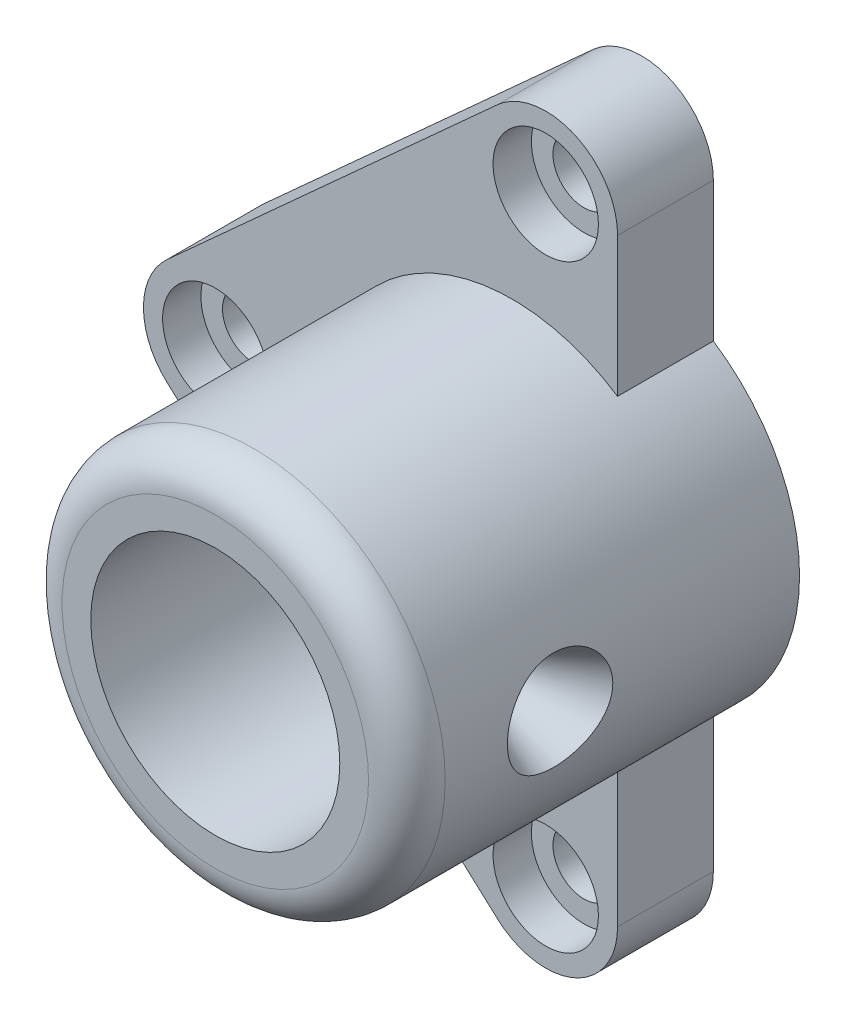
ISO-10303-21;
HEADER;
FILE_DESCRIPTION(('STEP AP214'),'2;1');
FILE_NAME('part.step','',(''),(''),'','','');
FILE_SCHEMA(('AUTOMOTIVE_DESIGN { 1 0 10303 214 1 1 1 1 }'));
ENDSEC;
DATA;
#1=APPLICATION_CONTEXT('core data for automotive mechanical design processes');
#2=APPLICATION_PROTOCOL_DEFINITION('international standard','automotive_design',2000,#1);
#3=PRODUCT_CONTEXT('',#1,'mechanical');
#4=PRODUCT('Part','Part','',(#3));
#5=PRODUCT_RELATED_PRODUCT_CATEGORY('part','',(#4));
#6=PRODUCT_DEFINITION_FORMATION('','',#4);
#7=PRODUCT_DEFINITION_CONTEXT('part definition',#1,'design');
#8=PRODUCT_DEFINITION('design','',#6,#7);
#9=PRODUCT_DEFINITION_SHAPE('','',#8);
#10=(LENGTH_UNIT() NAMED_UNIT(*) SI_UNIT(.MILLI.,.METRE.));
#11=(NAMED_UNIT(*) PLANE_ANGLE_UNIT() SI_UNIT($,.RADIAN.));
#12=(NAMED_UNIT(*) SI_UNIT($,.STERADIAN.) SOLID_ANGLE_UNIT());
#13=UNCERTAINTY_MEASURE_WITH_UNIT(LENGTH_MEASURE(1.E-05),#10,'distance_accuracy_value','');
#14=(GEOMETRIC_REPRESENTATION_CONTEXT(3) GLOBAL_UNCERTAINTY_ASSIGNED_CONTEXT((#13)) GLOBAL_UNIT_ASSIGNED_CONTEXT((#10,
#11,#12)) REPRESENTATION_CONTEXT('',''));
#15=CARTESIAN_POINT('',(0.,0.,0.));
#16=DIRECTION('',(0.,0.,1.));
#17=DIRECTION('',(1.,0.,0.));
#18=AXIS2_PLACEMENT_3D('',#15,#16,#17);
#19=CARTESIAN_POINT('',(0.,0.,82.));
#20=DIRECTION('',(0.,0.,-1.));
#21=DIRECTION('',(-1.,0.,0.));
#22=AXIS2_PLACEMENT_3D('',#19,#20,#21);
#23=CYLINDRICAL_SURFACE('',#22,26.);
#24=CARTESIAN_POINT('',(0.,0.,82.));
#25=DIRECTION('',(0.,0.,1.));
#26=DIRECTION('',(1.,0.,0.));
#27=AXIS2_PLACEMENT_3D('',#24,#25,#26);
#28=CIRCLE('',#27,26.);
#29=CARTESIAN_POINT('',(26.,0.,82.));
#30=VERTEX_POINT('',#29);
#31=EDGE_CURVE('E177',#30,#30,#28,.T.);
#32=ORIENTED_EDGE('',*,*,#31,.T.);
#33=EDGE_LOOP('',(#32));
#34=FACE_BOUND('',#33,.T.);
#35=CARTESIAN_POINT('',(26.,0.,45.));
#36=CARTESIAN_POINT('',(26.00000128243,-0.139098195780729,44.9999973910361));
#37=CARTESIAN_POINT('',(25.9988817850533,-0.278163093367462,45.005806065915));
#38=CARTESIAN_POINT('',(25.9944378015782,-0.555334569910838,45.028990391674));
#39=CARTESIAN_POINT('',(25.9911128838052,-0.69344095590614,45.0463683070441));
#40=CARTESIAN_POINT('',(25.9823468638532,-0.967727876986162,45.0925709934681));
#41=CARTESIAN_POINT('',(25.9769046295694,-1.10390734132981,45.121401888473));
#42=CARTESIAN_POINT('',(25.9640539710597,-1.37335317178624,45.1902969006897));
#43=CARTESIAN_POINT('',(25.9566448244308,-1.5066184480786,45.2303651454352));
#44=CARTESIAN_POINT('',(25.9400777859745,-1.76907725225023,45.3213642345133));
#45=CARTESIAN_POINT('',(25.9309221931612,-1.89827587582844,45.3722808083452));
#46=CARTESIAN_POINT('',(25.911104430191,-2.15194332659034,45.4846494437478));
#47=CARTESIAN_POINT('',(25.9004417048189,-2.27641038916633,45.546105389725));
#48=CARTESIAN_POINT('',(25.8779094191981,-2.51966664126715,45.6790644055367));
#49=CARTESIAN_POINT('',(25.8660404147299,-2.63845840886966,45.7505628541409));
#50=CARTESIAN_POINT('',(25.8414102153448,-2.86967642451499,45.9031535022098));
#51=CARTESIAN_POINT('',(25.8286486884198,-2.98210027531709,45.9842492796186));
#52=CARTESIAN_POINT('',(25.8024421572251,-3.20097821057031,46.1563905233969));
#53=CARTESIAN_POINT('',(25.7889912217317,-3.30735391905022,46.247534756282));
#54=CARTESIAN_POINT('',(25.7619048227286,-3.51211211706086,46.4384456248307));
#55=CARTESIAN_POINT('',(25.7482692927008,-3.61049163064933,46.5382154424266));
#56=CARTESIAN_POINT('',(25.721202853471,-3.79851889966349,46.7456425873518));
#57=CARTESIAN_POINT('',(25.707771885596,-3.88816920018256,46.8532975995329));
#58=CARTESIAN_POINT('',(25.6814824984122,-4.05818429427359,47.0758321048208));
#59=CARTESIAN_POINT('',(25.6686242920977,-4.13854565097106,47.1907142478157));
#60=CARTESIAN_POINT('',(25.6437507491722,-4.28998732526708,47.4278516555159));
#61=CARTESIAN_POINT('',(25.6317429902835,-4.36098813212465,47.550158615209));
#62=CARTESIAN_POINT('',(25.6090303907993,-4.49243737988195,47.8004482275122));
#63=CARTESIAN_POINT('',(25.5983260389411,-4.55288186615487,47.9284329847288));
#64=CARTESIAN_POINT('',(25.5686725756277,-4.71758356517903,48.3194693572835));
#65=CARTESIAN_POINT('',(25.5521520068429,-4.80539082913906,48.5898880790335));
#66=CARTESIAN_POINT('',(25.5277851059543,-4.93319348500814,49.1385519824114));
#67=CARTESIAN_POINT('',(25.5198358125422,-4.9737568737807,49.416662138497));
#68=CARTESIAN_POINT('',(25.5131829043982,-5.00777610628065,49.9758846697083));
#69=CARTESIAN_POINT('',(25.5144784168635,-5.00123639701493,50.2569967589193));
#70=CARTESIAN_POINT('',(25.5260802151496,-4.94166940783617,50.8100732300795));
#71=CARTESIAN_POINT('',(25.5362611084689,-4.88928901385649,51.082110435608));
#72=CARTESIAN_POINT('',(25.5642880886633,-4.74055376184226,51.6134652201195));
#73=CARTESIAN_POINT('',(25.5821345165446,-4.64419694747603,51.8727822326645));
#74=CARTESIAN_POINT('',(25.6236120486049,-4.40961541759395,52.3732140894093));
#75=CARTESIAN_POINT('',(25.6472788082827,-4.27113134100965,52.6142042751129));
#76=CARTESIAN_POINT('',(25.6977069479892,-3.95641007271873,53.0697698881744));
#77=CARTESIAN_POINT('',(25.7244686576829,-3.78016885752474,53.2843424965743));
#78=CARTESIAN_POINT('',(25.7786164745845,-3.39145783063179,53.6847170832932));
#79=CARTESIAN_POINT('',(25.8060055726474,-3.1784352252573,53.869982384059));
#80=CARTESIAN_POINT('',(25.8579144210111,-2.72405331017049,54.2022310106155));
#81=CARTESIAN_POINT('',(25.8824341396341,-2.48269368767764,54.349213913792));
#82=CARTESIAN_POINT('',(25.9258949720895,-1.97791552554967,54.6008120951711));
#83=CARTESIAN_POINT('',(25.9448284520921,-1.71446742623273,54.705369469608));
#84=CARTESIAN_POINT('',(25.9749249443633,-1.17330113824765,54.8685948463202));
#85=CARTESIAN_POINT('',(25.9860888256766,-0.895584549270348,54.9272679809275));
#86=CARTESIAN_POINT('',(25.9992682565874,-0.338379830303339,54.9963075327037));
#87=CARTESIAN_POINT('',(26.0014229870363,-0.0589859559045563,55.0074089448941));
#88=CARTESIAN_POINT('',(25.9967265998234,0.497665273099564,54.9829644443947));
#89=CARTESIAN_POINT('',(25.9898759486079,0.774922737615086,54.9474209477441));
#90=CARTESIAN_POINT('',(25.9680253741972,1.31708448551589,54.8313065164243));
#91=CARTESIAN_POINT('',(25.9530931455519,1.58207180878127,54.7511094595413));
#92=CARTESIAN_POINT('',(25.9167470904917,2.0948391106724,54.5483704233571));
#93=CARTESIAN_POINT('',(25.8953328064491,2.34261787286919,54.4258254542422));
#94=CARTESIAN_POINT('',(25.8480509279767,2.81705737037191,54.1402565755127));
#95=CARTESIAN_POINT('',(25.822135234877,3.04344438938756,53.9767860490185));
#96=CARTESIAN_POINT('',(25.7688451137708,3.46583719199924,53.6146073208902));
#97=CARTESIAN_POINT('',(25.7414705421556,3.66183997719088,53.4158956457006));
#98=CARTESIAN_POINT('',(25.6878832381845,4.02071027471095,52.9855445559817));
#99=CARTESIAN_POINT('',(25.6616921581473,4.18307505303114,52.7534828004893));
#100=CARTESIAN_POINT('',(25.6138822201812,4.46651870841569,52.2649360505246));
#101=CARTESIAN_POINT('',(25.5922631871101,4.58759916707369,52.0084519921474));
#102=CARTESIAN_POINT('',(25.5562146077168,4.78433868028939,51.4796395448304));
#103=CARTESIAN_POINT('',(25.5417494261111,4.86022326245296,51.2073973927492));
#104=CARTESIAN_POINT('',(25.521575749456,4.96509210074319,50.6535641994356));
#105=CARTESIAN_POINT('',(25.5158662089013,4.99408195656079,50.3719742785173));
#106=CARTESIAN_POINT('',(25.5143666040174,5.00169745119354,49.9515799904159));
#107=CARTESIAN_POINT('',(25.5150115622038,4.9984233730953,49.8128848027259));
#108=CARTESIAN_POINT('',(25.5185418770053,4.98037531938878,49.536287506806));
#109=CARTESIAN_POINT('',(25.5214263855741,4.96560569677111,49.3983851182765));
#110=CARTESIAN_POINT('',(25.5293565631499,4.92467036099147,49.1243066837505));
#111=CARTESIAN_POINT('',(25.5344029923743,4.89850063904593,48.9881312623834));
#112=CARTESIAN_POINT('',(25.5465062848218,4.83498318828809,48.7185539777311));
#113=CARTESIAN_POINT('',(25.553562429272,4.79763945560994,48.5851511411031));
#114=CARTESIAN_POINT('',(25.5694685515132,4.71212938240753,48.3222291441991));
#115=CARTESIAN_POINT('',(25.578315400985,4.66398190006566,48.192703657143));
#116=CARTESIAN_POINT('',(25.5975551763323,4.55720406797804,47.9382228949703));
#117=CARTESIAN_POINT('',(25.6079475533512,4.49857743816031,47.8132660169701));
#118=CARTESIAN_POINT('',(25.6299934506701,4.37122536460538,47.5686609819221));
#119=CARTESIAN_POINT('',(25.6416474869804,4.30249578468483,47.4490150254296));
#120=CARTESIAN_POINT('',(25.6658855163733,4.15546242716184,47.2159176939682));
#121=CARTESIAN_POINT('',(25.6784691878078,4.07716195494949,47.1024641998503));
#122=CARTESIAN_POINT('',(25.7044327109533,3.9101651450708,46.880675264668));
#123=CARTESIAN_POINT('',(25.7178221224797,3.82132166725485,46.7724517027036));
#124=CARTESIAN_POINT('',(25.7448283120819,3.63492472447239,46.5638864100167));
#125=CARTESIAN_POINT('',(25.7584450082883,3.53737434299833,46.4635419124541));
#126=CARTESIAN_POINT('',(25.7855394220868,3.33413706596718,46.271313150041));
#127=CARTESIAN_POINT('',(25.7990170524896,3.22844538044321,46.1794339366645));
#128=CARTESIAN_POINT('',(25.8254458734074,3.00972964248704,46.0048656861615));
#129=CARTESIAN_POINT('',(25.8383972560048,2.89670830522931,45.9221732763532));
#130=CARTESIAN_POINT('',(25.86354410547,2.66290145933283,45.7657426779706));
#131=CARTESIAN_POINT('',(25.8757307714914,2.54204990146172,45.6921017420601));
#132=CARTESIAN_POINT('',(25.8988560060756,2.29449473444564,45.555308013524));
#133=CARTESIAN_POINT('',(25.9097950324044,2.16779329578012,45.4921513702538));
#134=CARTESIAN_POINT('',(25.9301122185035,1.9094626859203,45.3768035814581));
#135=CARTESIAN_POINT('',(25.9394913571846,1.77783666917816,45.324605553393));
#136=CARTESIAN_POINT('',(25.9564273535261,1.51057041709534,45.2315404223472));
#137=CARTESIAN_POINT('',(25.9639845721592,1.37493098291215,45.1906710746022));
#138=CARTESIAN_POINT('',(25.980137569936,1.03593953494328,45.1040663401127));
#139=CARTESIAN_POINT('',(25.9875482864984,0.830762807269964,45.0650929543648));
#140=CARTESIAN_POINT('',(25.9974784726212,0.417032390492763,45.0130620990212));
#141=CARTESIAN_POINT('',(25.9999980779085,0.208478795258006,45.0000039102855));
#142=CARTESIAN_POINT('',(26.,0.,45.));
#143=B_SPLINE_CURVE_WITH_KNOTS('',3,(#35,#36,#37,#38,#39,#40,#41,#42,#43,#44,#45,#46,#47,#48,
#49,#50,#51,#52,#53,#54,#55,#56,#57,#58,#59,#60,#61,#62,#63,#64,#65,#66,#67,#68,#69,#70,#71,#72,
#73,#74,#75,#76,#77,#78,#79,#80,#81,#82,#83,#84,#85,#86,#87,#88,#89,#90,#91,#92,#93,#94,#95,#96,
#97,#98,#99,#100,#101,#102,#103,#104,#105,#106,#107,#108,#109,#110,#111,#112,#113,#114,#115,
#116,#117,#118,#119,#120,#121,#122,#123,#124,#125,#126,#127,#128,#129,#130,#131,#132,#133,#134,
#135,#136,#137,#138,#139,#140,#141,#142),.UNSPECIFIED.,.T.,.F.,(4,2,2,2,2,2,2,2,2,2,2,2,2,2,2,2,
2,2,2,2,2,2,2,2,2,2,2,2,2,2,2,2,2,2,2,2,2,2,2,2,2,2,2,2,2,2,2,2,2,2,2,2,2,4),(0.,
0.417111611398396,0.834304889598899,1.25172154351447,1.66929171786899,2.08631595147723,
2.50349421576772,2.92048113344245,3.33762399907484,3.7593111675501,4.18115456341101,
4.60287459580003,5.0247501669197,5.45000550525302,5.87541981332372,6.72524307938186,
7.56474015655585,8.40415797778932,9.23191787086898,10.0597145912015,10.8927145742863,
11.7258033679538,12.5727204483932,13.4196468778793,14.267725363681,15.1157089750067,
15.9505426908707,16.7853331670463,17.6132369467634,18.4411991894332,19.2786239959612,
20.1161313894649,20.9653730722101,21.8145822170279,22.6595175077965,23.5043518975422,
23.9201518330802,24.3357943951977,24.7515832339167,25.1672235524515,25.5821439287858,
25.9969173065549,26.4118609694065,26.8266617306505,27.2481441020027,27.6694777959548,
28.0910613049364,28.5124895260964,28.938109821233,29.3635734480985,29.7887690585655,
30.213880356713,30.839059849035,31.4642219925436),.UNSPECIFIED.);
#144=CARTESIAN_POINT('',(26.,0.,45.));
#145=VERTEX_POINT('',#144);
#146=EDGE_CURVE('E190',#145,#145,#143,.T.);
#147=ORIENTED_EDGE('',*,*,#146,.F.);
#148=EDGE_LOOP('',(#147));
#149=FACE_BOUND('',#148,.T.);
#150=CARTESIAN_POINT('',(0.,0.,6.00000000000001));
#151=DIRECTION('',(0.,0.,-1.));
#152=DIRECTION('',(-1.,0.,0.));
#153=AXIS2_PLACEMENT_3D('',#150,#151,#152);
#154=CIRCLE('',#153,26.);
#155=CARTESIAN_POINT('',(-26.,0.,6.00000000000001));
#156=VERTEX_POINT('',#155);
#157=EDGE_CURVE('E51',#156,#156,#154,.T.);
#158=ORIENTED_EDGE('',*,*,#157,.T.);
#159=EDGE_LOOP('',(#158));
#160=FACE_BOUND('',#159,.T.);
#161=ADVANCED_FACE('F47',(#34,#149,#160),#23,.F.);
#162=CARTESIAN_POINT('',(0.,0.,82.));
#163=DIRECTION('',(0.,0.,1.));
#164=DIRECTION('',(1.,0.,0.));
#165=AXIS2_PLACEMENT_3D('',#162,#163,#164);
#166=PLANE('',#165);
#167=CARTESIAN_POINT('',(0.,0.,82.));
#168=DIRECTION('',(0.,0.,1.));
#169=DIRECTION('',(1.,0.,0.));
#170=AXIS2_PLACEMENT_3D('',#167,#168,#169);
#171=CIRCLE('',#170,32.);
#172=CARTESIAN_POINT('',(32.,0.,82.));
#173=VERTEX_POINT('',#172);
#174=EDGE_CURVE('E182',#173,#173,#171,.T.);
#175=ORIENTED_EDGE('',*,*,#174,.T.);
#176=EDGE_LOOP('',(#175));
#177=FACE_BOUND('',#176,.T.);
#178=ORIENTED_EDGE('',*,*,#31,.F.);
#179=EDGE_LOOP('',(#178));
#180=FACE_BOUND('',#179,.T.);
#181=ADVANCED_FACE('F276',(#177,#180),#166,.T.);
#182=CARTESIAN_POINT('',(0.,0.,0.));
#183=DIRECTION('',(0.,0.,1.));
#184=DIRECTION('',(1.,0.,0.));
#185=AXIS2_PLACEMENT_3D('',#182,#183,#184);
#186=PLANE('',#185);
#187=CARTESIAN_POINT('',(0.,0.,0.));
#188=DIRECTION('',(0.,0.,-1.));
#189=DIRECTION('',(-1.,0.,0.));
#190=AXIS2_PLACEMENT_3D('',#187,#188,#189);
#191=CIRCLE('',#190,30.);
#192=CARTESIAN_POINT('',(-30.,0.,0.));
#193=VERTEX_POINT('',#192);
#194=EDGE_CURVE('E291',#193,#193,#191,.T.);
#195=ORIENTED_EDGE('',*,*,#194,.F.);
#196=EDGE_LOOP('',(#195));
#197=FACE_BOUND('',#196,.T.);
#198=CARTESIAN_POINT('',(-62.,0.,0.));
#199=DIRECTION('',(0.,0.,1.));
#200=DIRECTION('',(1.,0.,0.));
#201=AXIS2_PLACEMENT_3D('',#198,#199,#200);
#202=CIRCLE('',#201,6.5);
#203=CARTESIAN_POINT('',(-55.5,0.,0.));
#204=VERTEX_POINT('',#203);
#205=EDGE_CURVE('E295',#204,#204,#202,.T.);
#206=ORIENTED_EDGE('',*,*,#205,.T.);
#207=EDGE_LOOP('',(#206));
#208=FACE_BOUND('',#207,.T.);
#209=CARTESIAN_POINT('',(7.,62.5,0.));
#210=DIRECTION('',(0.,0.,1.));
#211=DIRECTION('',(1.,0.,0.));
#212=AXIS2_PLACEMENT_3D('',#209,#210,#211);
#213=CIRCLE('',#212,6.5);
#214=CARTESIAN_POINT('',(13.5,62.5,0.));
#215=VERTEX_POINT('',#214);
#216=EDGE_CURVE('E299',#215,#215,#213,.T.);
#217=ORIENTED_EDGE('',*,*,#216,.T.);
#218=EDGE_LOOP('',(#217));
#219=FACE_BOUND('',#218,.T.);
#220=CARTESIAN_POINT('',(7.,-62.5,0.));
#221=DIRECTION('',(0.,0.,1.));
#222=DIRECTION('',(1.,0.,0.));
#223=AXIS2_PLACEMENT_3D('',#220,#221,#222);
#224=CIRCLE('',#223,6.5);
#225=CARTESIAN_POINT('',(13.5,-62.5,0.));
#226=VERTEX_POINT('',#225);
#227=EDGE_CURVE('E149',#226,#226,#224,.T.);
#228=ORIENTED_EDGE('',*,*,#227,.T.);
#229=EDGE_LOOP('',(#228));
#230=FACE_BOUND('',#229,.T.);
#231=CARTESIAN_POINT('',(0.,0.,0.));
#232=DIRECTION('',(0.,0.,1.));
#233=DIRECTION('',(1.,0.,0.));
#234=AXIS2_PLACEMENT_3D('',#231,#232,#233);
#235=CIRCLE('',#234,40.);
#236=CARTESIAN_POINT('',(22.,-33.4065861769801,0.));
#237=VERTEX_POINT('',#236);
#238=CARTESIAN_POINT('',(22.,33.4065861769801,0.));
#239=VERTEX_POINT('',#238);
#240=EDGE_CURVE('E180',#237,#239,#235,.T.);
#241=ORIENTED_EDGE('',*,*,#240,.F.);
#242=DIRECTION('',(0.,1.,0.));
#243=VECTOR('',#242,1.);
#244=CARTESIAN_POINT('',(22.,-62.5,0.));
#245=LINE('',#244,#243);
#246=CARTESIAN_POINT('',(22.,-62.5,0.));
#247=VERTEX_POINT('',#246);
#248=EDGE_CURVE('E119',#247,#237,#245,.T.);
#249=ORIENTED_EDGE('',*,*,#248,.F.);
#250=CARTESIAN_POINT('',(7.,-62.5,0.));
#251=DIRECTION('',(0.,0.,1.));
#252=DIRECTION('',(1.,0.,0.));
#253=AXIS2_PLACEMENT_3D('',#250,#251,#252);
#254=CIRCLE('',#253,15.);
#255=CARTESIAN_POINT('',(-3.0700265267584,-73.6173092855413,0.));
#256=VERTEX_POINT('',#255);
#257=EDGE_CURVE('E157',#256,#247,#254,.T.);
#258=ORIENTED_EDGE('',*,*,#257,.F.);
#259=DIRECTION('',(0.741153952369418,-0.671335101783893,0.));
#260=VECTOR('',#259,1.);
#261=CARTESIAN_POINT('',(-3.07002652675839,-73.6173092855413,0.));
#262=LINE('',#261,#260);
#263=CARTESIAN_POINT('',(-72.0700265267584,-11.1173092855413,0.));
#264=VERTEX_POINT('',#263);
#265=EDGE_CURVE('E155',#264,#256,#262,.T.);
#266=ORIENTED_EDGE('',*,*,#265,.F.);
#267=CARTESIAN_POINT('',(-62.,0.,0.));
#268=DIRECTION('',(0.,0.,1.));
#269=DIRECTION('',(-1.,0.,0.));
#270=AXIS2_PLACEMENT_3D('',#267,#268,#269);
#271=CIRCLE('',#270,15.);
#272=CARTESIAN_POINT('',(-72.0700265267584,11.1173092855413,0.));
#273=VERTEX_POINT('',#272);
#274=EDGE_CURVE('E153',#273,#264,#271,.T.);
#275=ORIENTED_EDGE('',*,*,#274,.F.);
#276=DIRECTION('',(-0.741153952369418,-0.671335101783893,0.));
#277=VECTOR('',#276,1.);
#278=CARTESIAN_POINT('',(-72.0700265267584,11.1173092855413,0.));
#279=LINE('',#278,#277);
#280=CARTESIAN_POINT('',(-3.07002652675839,73.6173092855413,0.));
#281=VERTEX_POINT('',#280);
#282=EDGE_CURVE('E151',#281,#273,#279,.T.);
#283=ORIENTED_EDGE('',*,*,#282,.F.);
#284=CARTESIAN_POINT('',(7.,62.5,0.));
#285=DIRECTION('',(0.,0.,1.));
#286=DIRECTION('',(-1.,0.,0.));
#287=AXIS2_PLACEMENT_3D('',#284,#285,#286);
#288=CIRCLE('',#287,15.);
#289=CARTESIAN_POINT('',(22.,62.5,0.));
#290=VERTEX_POINT('',#289);
#291=EDGE_CURVE('E148',#290,#281,#288,.T.);
#292=ORIENTED_EDGE('',*,*,#291,.F.);
#293=DIRECTION('',(0.,1.,0.));
#294=VECTOR('',#293,1.);
#295=CARTESIAN_POINT('',(22.,62.5,0.));
#296=LINE('',#295,#294);
#297=EDGE_CURVE('E125',#239,#290,#296,.T.);
#298=ORIENTED_EDGE('',*,*,#297,.F.);
#299=EDGE_LOOP('',(#241,#249,#258,#266,#275,#283,#292,#298));
#300=FACE_BOUND('',#299,.T.);
#301=ADVANCED_FACE('F279',(#197,#208,#219,#230,#300),#186,.F.);
#302=CARTESIAN_POINT('',(0.,0.,82.));
#303=DIRECTION('',(0.,0.,-1.));
#304=DIRECTION('',(-1.,0.,0.));
#305=AXIS2_PLACEMENT_3D('',#302,#303,#304);
#306=CYLINDRICAL_SURFACE('',#305,40.);
#307=CARTESIAN_POINT('',(39.2750817255295,-7.58076530877896,42.5027016648812));
#308=CARTESIAN_POINT('',(39.2348742803046,-7.78907626430152,42.7399912601435));
#309=CARTESIAN_POINT('',(39.1949630201123,-7.986948315553,42.9864165670778));
#310=CARTESIAN_POINT('',(39.1169103018654,-8.36084960361184,43.4957077083518));
#311=CARTESIAN_POINT('',(39.0787693286866,-8.53687287795806,43.7585780011686));
#312=CARTESIAN_POINT('',(39.0053753361394,-8.86618294648203,44.2989289708946));
#313=CARTESIAN_POINT('',(38.9701252542205,-9.01944673971651,44.5764240492629));
#314=CARTESIAN_POINT('',(38.9036048230007,-9.30218429787523,45.1437374980762));
#315=CARTESIAN_POINT('',(38.8723344725372,-9.43165806974972,45.4335558649209));
#316=CARTESIAN_POINT('',(38.8151304829796,-9.66435700452859,46.0190731058962));
#317=CARTESIAN_POINT('',(38.7891250969262,-9.76794032094785,46.3146227319419));
#318=CARTESIAN_POINT('',(38.7426390787253,-9.95071946650734,46.9135947059881));
#319=CARTESIAN_POINT('',(38.7221584535253,-10.0299152649797,47.2170170638882));
#320=CARTESIAN_POINT('',(38.6873280820391,-10.1634349860778,47.8295137914619));
#321=CARTESIAN_POINT('',(38.672976072943,-10.2177680890484,48.1385860310541));
#322=CARTESIAN_POINT('',(38.6508140971718,-10.3012833931755,48.7603433026637));
#323=CARTESIAN_POINT('',(38.643004158809,-10.3304654854854,49.0730283503104));
#324=CARTESIAN_POINT('',(38.6341119210962,-10.3636721023425,49.7030637055696));
#325=CARTESIAN_POINT('',(38.633099813708,-10.3674341510307,50.0204288748533));
#326=CARTESIAN_POINT('',(38.6380201687644,-10.349081401967,50.6543577557163));
#327=CARTESIAN_POINT('',(38.6439526895623,-10.326966386779,50.9709214605388));
#328=CARTESIAN_POINT('',(38.6625842756202,-10.2569919898319,51.6010276208653));
#329=CARTESIAN_POINT('',(38.6752841499593,-10.2091295297998,51.9145697105522));
#330=CARTESIAN_POINT('',(38.7070688824222,-10.087950042744,52.5363658266941));
#331=CARTESIAN_POINT('',(38.7261537368603,-10.0146330304146,52.8446198562016));
#332=CARTESIAN_POINT('',(38.770116965714,-9.84306137794109,53.4533710728023));
#333=CARTESIAN_POINT('',(38.7949898982389,-9.74483015412743,53.75387525324));
#334=CARTESIAN_POINT('',(38.8498013101241,-9.52396322301498,54.3453022104371));
#335=CARTESIAN_POINT('',(38.8797398050082,-9.40132744092559,54.63622495783));
#336=CARTESIAN_POINT('',(38.9437951779269,-9.13235548726035,55.2063825412573));
#337=CARTESIAN_POINT('',(38.9779115779745,-8.98602202627855,55.4856187094376));
#338=CARTESIAN_POINT('',(39.0493375293122,-8.6703761553303,56.0305371688495));
#339=CARTESIAN_POINT('',(39.0866485439578,-8.50105319354911,56.296213158677));
#340=CARTESIAN_POINT('',(39.1633161086822,-8.1405522549473,56.8116661059887));
#341=CARTESIAN_POINT('',(39.2026709629649,-7.94939224342742,57.0614558733631));
#342=CARTESIAN_POINT('',(39.2822631121207,-7.54625628299553,57.543289222654));
#343=CARTESIAN_POINT('',(39.3224999778417,-7.33429029019961,57.7753411988419));
#344=CARTESIAN_POINT('',(39.4026632838395,-6.89064097379369,58.2199146799047));
#345=CARTESIAN_POINT('',(39.4425896735567,-6.65895450924749,58.4324330623548));
#346=CARTESIAN_POINT('',(39.52088691027,-6.17729750598093,58.8359583828419));
#347=CARTESIAN_POINT('',(39.5592578223604,-5.92732773361792,59.0269662216566));
#348=CARTESIAN_POINT('',(39.6318856248087,-5.42004591164968,59.3791131186034));
#349=CARTESIAN_POINT('',(39.6662409476819,-5.16332320482356,59.5410805802085));
#350=CARTESIAN_POINT('',(39.7313112560805,-4.63610045485143,59.8416300260163));
#351=CARTESIAN_POINT('',(39.7620265251459,-4.36560148714929,59.9802138320325));
#352=CARTESIAN_POINT('',(39.8188285020127,-3.81287718819458,60.2324273862666));
#353=CARTESIAN_POINT('',(39.844917288262,-3.53065719330413,60.3460683455432));
#354=CARTESIAN_POINT('',(39.8916220415037,-2.95658380108389,60.547117942894));
#355=CARTESIAN_POINT('',(39.9122384213329,-2.66473113230932,60.6345285598436));
#356=CARTESIAN_POINT('',(39.9459909521145,-2.09590810328758,60.7765063182095));
#357=CARTESIAN_POINT('',(39.9595706096332,-1.81945312945552,60.8330380952465));
#358=CARTESIAN_POINT('',(39.9810426479432,-1.26248652058825,60.9220520030944));
#359=CARTESIAN_POINT('',(39.9889354216252,-0.98197516716289,60.9545357953164));
#360=CARTESIAN_POINT('',(39.99879360555,-0.419169040990916,60.9950668780009));
#361=CARTESIAN_POINT('',(40.000760700249,-0.136874797925077,61.0031211129082));
#362=CARTESIAN_POINT('',(39.9987120434032,0.427323998486598,60.9947156289412));
#363=CARTESIAN_POINT('',(39.9946964384946,0.709228561214013,60.9782565108907));
#364=CARTESIAN_POINT('',(39.9811670981322,1.25583149216866,60.9225119205927));
#365=CARTESIAN_POINT('',(39.9719495005048,1.52066358538435,60.8844553394054));
#366=CARTESIAN_POINT('',(39.948495007044,2.04620475010684,60.7868746552869));
#367=CARTESIAN_POINT('',(39.9342564712873,2.30691244541149,60.7273435382633));
#368=CARTESIAN_POINT('',(39.9011460616656,2.82226901443658,60.5874460215557));
#369=CARTESIAN_POINT('',(39.8822757887682,3.07691994839609,60.5070868205969));
#370=CARTESIAN_POINT('',(39.8403829081101,3.57873105799256,60.3262680356889));
#371=CARTESIAN_POINT('',(39.8173587079856,3.82588831842146,60.2258007418952));
#372=CARTESIAN_POINT('',(39.7673175436534,4.31532312931589,60.0038009460013));
#373=CARTESIAN_POINT('',(39.7402385551271,4.55744295889224,59.8819349628343));
#374=CARTESIAN_POINT('',(39.6830678338931,5.03100854580705,59.61938759348));
#375=CARTESIAN_POINT('',(39.6529748045986,5.26244964626963,59.4786981009371));
#376=CARTESIAN_POINT('',(39.5905275438794,5.71331163006708,59.17969507632));
#377=CARTESIAN_POINT('',(39.5581733677747,5.93273280724074,59.0213819753594));
#378=CARTESIAN_POINT('',(39.4919744666378,6.35848874973694,58.6883166897716));
#379=CARTESIAN_POINT('',(39.4581296438949,6.56482265503045,58.5135634266505));
#380=CARTESIAN_POINT('',(39.3874074427726,6.97701885854491,58.1364195636319));
#381=CARTESIAN_POINT('',(39.3504804672184,7.18189285506682,57.9329573941436));
#382=CARTESIAN_POINT('',(39.2767909056188,7.57453613235435,57.5102462556218));
#383=CARTESIAN_POINT('',(39.2400282769683,7.76231012391561,57.2910016643909));
#384=CARTESIAN_POINT('',(39.167568033147,8.12003356084703,56.8380583926786));
#385=CARTESIAN_POINT('',(39.1318710330379,8.28997284943571,56.6043515951704));
#386=CARTESIAN_POINT('',(39.0624688506413,8.61106883903831,56.1242007233329));
#387=CARTESIAN_POINT('',(39.0287631073893,8.76223084323166,55.8777602732776));
#388=CARTESIAN_POINT('',(38.9620840770448,9.05427400391365,55.3573358182777));
#389=CARTESIAN_POINT('',(38.9292985487759,9.19386146788624,55.0826007519844));
#390=CARTESIAN_POINT('',(38.867844585655,9.45029365170378,54.5222647393384));
#391=CARTESIAN_POINT('',(38.839176320837,9.56713743235513,54.2366633448459));
#392=CARTESIAN_POINT('',(38.786763814319,9.77745918853758,53.6565149250958));
#393=CARTESIAN_POINT('',(38.7630199966925,9.87093515186874,53.3619671319123));
#394=CARTESIAN_POINT('',(38.7211330860079,10.0339893914503,52.7659442671576));
#395=CARTESIAN_POINT('',(38.7029899571369,10.10356782051,52.4644692398947));
#396=CARTESIAN_POINT('',(38.6724642916362,10.2197951476221,51.8494101220238));
#397=CARTESIAN_POINT('',(38.6602285565545,10.2658611987494,51.5357084100709));
#398=CARTESIAN_POINT('',(38.6425377862838,10.3322531748548,50.9053988589013));
#399=CARTESIAN_POINT('',(38.6370828778965,10.352578618483,50.5887909654503));
#400=CARTESIAN_POINT('',(38.6331185595793,10.3673627378997,49.9549257153379));
#401=CARTESIAN_POINT('',(38.6346091945528,10.3618212464567,49.6376683544908));
#402=CARTESIAN_POINT('',(38.6444910867077,10.324905409097,49.0047701441357));
#403=CARTESIAN_POINT('',(38.652882310065,10.2935311898027,48.6891292867117));
#404=CARTESIAN_POINT('',(38.6763005331838,10.2051878142552,48.0620237248297));
#405=CARTESIAN_POINT('',(38.6913208621391,10.1482443870535,47.7505551456701));
#406=CARTESIAN_POINT('',(38.7275459769432,10.0091130130277,47.133674552668));
#407=CARTESIAN_POINT('',(38.7487507795647,9.92692499773893,46.8282625552536));
#408=CARTESIAN_POINT('',(38.7967162978783,9.73777779023987,46.2256213309362));
#409=CARTESIAN_POINT('',(38.8234775847411,9.63081605132009,45.9283929488162));
#410=CARTESIAN_POINT('',(38.8817632159806,9.39273651130746,45.3442547765765));
#411=CARTESIAN_POINT('',(38.9132875732133,9.26161864501474,45.0573450143103));
#412=CARTESIAN_POINT('',(38.980224682245,8.97572624207088,44.495446333726));
#413=CARTESIAN_POINT('',(39.0156436070192,8.82091399256849,44.220477332584));
#414=CARTESIAN_POINT('',(39.0892953309614,8.4885780131828,43.6848794686663));
#415=CARTESIAN_POINT('',(39.1275291174794,8.31104629787115,43.4242556942282));
#416=CARTESIAN_POINT('',(39.2056601484929,7.93430563619209,42.9194709490542));
#417=CARTESIAN_POINT('',(39.2455572391453,7.73509869188775,42.6753084612169));
#418=CARTESIAN_POINT('',(39.3258171914605,7.31611787356701,42.205405957173));
#419=CARTESIAN_POINT('',(39.3661800282688,7.09634509263611,41.9796649630466));
#420=CARTESIAN_POINT('',(39.4454573314235,6.64140700785019,41.5522144617394));
#421=CARTESIAN_POINT('',(39.484384753344,6.40656633794875,41.3501620544328));
#422=CARTESIAN_POINT('',(39.560297842794,5.91975319819467,40.9676567532716));
#423=CARTESIAN_POINT('',(39.5972843090138,5.66778787455236,40.7871949352812));
#424=CARTESIAN_POINT('',(39.6681677087884,5.14831662684484,40.4495939412178));
#425=CARTESIAN_POINT('',(39.7020651149666,4.88081309040103,40.2924511950291));
#426=CARTESIAN_POINT('',(39.7656743889439,4.33213313461256,40.0031698682913));
#427=CARTESIAN_POINT('',(39.7953865524536,4.05095768315425,39.8710295209583));
#428=CARTESIAN_POINT('',(39.847903002817,3.49535022172584,39.6408648412543));
#429=CARTESIAN_POINT('',(39.8710262400896,3.2216247635236,39.5412063723966));
#430=CARTESIAN_POINT('',(39.9120209890024,2.6661061107324,39.3662944070684));
#431=CARTESIAN_POINT('',(39.9298929054053,2.38431353978097,39.2910390296032));
#432=CARTESIAN_POINT('',(39.9598182087977,1.8149790488908,39.165847676756));
#433=CARTESIAN_POINT('',(39.9718741330215,1.52743969311316,39.1159006600881));
#434=CARTESIAN_POINT('',(39.9897913171595,0.948859649840928,39.0418986595052));
#435=CARTESIAN_POINT('',(39.9956529043072,0.65781914812589,39.0178423078412));
#436=CARTESIAN_POINT('',(40.0008065382339,0.0951003124257262,38.9966878218493));
#437=CARTESIAN_POINT('',(40.0005292053778,-0.176509227544688,38.9978226455421));
#438=CARTESIAN_POINT('',(39.9944627592012,-0.718622375965732,39.0227325863448));
#439=CARTESIAN_POINT('',(39.9886738075506,-0.989126016621513,39.0465070393759));
#440=CARTESIAN_POINT('',(39.9717464137994,-1.52706118602456,39.1164358551323));
#441=CARTESIAN_POINT('',(39.9606077384588,-1.79449258030588,39.1625911936318));
#442=CARTESIAN_POINT('',(39.9332902822772,-2.3243736535612,39.2767864230156));
#443=CARTESIAN_POINT('',(39.9171114868843,-2.58682331814964,39.344826377085));
#444=CARTESIAN_POINT('',(39.8803778599831,-3.10182357692447,39.5011384344979));
#445=CARTESIAN_POINT('',(39.8598782495336,-3.35445545177682,39.5891562155324));
#446=CARTESIAN_POINT('',(39.8149131806211,-3.85162604785664,39.7850611939523));
#447=CARTESIAN_POINT('',(39.7904462612301,-4.09616174763838,39.8929557127784));
#448=CARTESIAN_POINT('',(39.7381873607097,-4.57542602437693,40.1275397561203));
#449=CARTESIAN_POINT('',(39.7103980788108,-4.81016235634856,40.2542140429607));
#450=CARTESIAN_POINT('',(39.652154615416,-5.26878748380134,40.5253729281216));
#451=CARTESIAN_POINT('',(39.6216998449733,-5.49267386489181,40.6698614654455));
#452=CARTESIAN_POINT('',(39.5406417465161,-6.05461170232263,41.0640595995262));
#453=CARTESIAN_POINT('',(39.4885752973705,-6.38377406202537,41.3262816100075));
#454=CARTESIAN_POINT('',(39.3825254731831,-7.00836779237761,41.8878488270143));
#455=CARTESIAN_POINT('',(39.328541793613,-7.30379377272345,42.1871999500294));
#456=CARTESIAN_POINT('',(39.2750817255295,-7.58076530877896,42.5027016648812));
#457=B_SPLINE_CURVE_WITH_KNOTS('',3,(#307,#308,#309,#310,#311,#312,#313,#314,#315,#316,#317,
#318,#319,#320,#321,#322,#323,#324,#325,#326,#327,#328,#329,#330,#331,#332,#333,#334,#335,#336,
#337,#338,#339,#340,#341,#342,#343,#344,#345,#346,#347,#348,#349,#350,#351,#352,#353,#354,#355,
#356,#357,#358,#359,#360,#361,#362,#363,#364,#365,#366,#367,#368,#369,#370,#371,#372,#373,#374,
#375,#376,#377,#378,#379,#380,#381,#382,#383,#384,#385,#386,#387,#388,#389,#390,#391,#392,#393,
#394,#395,#396,#397,#398,#399,#400,#401,#402,#403,#404,#405,#406,#407,#408,#409,#410,#411,#412,
#413,#414,#415,#416,#417,#418,#419,#420,#421,#422,#423,#424,#425,#426,#427,#428,#429,#430,#431,
#432,#433,#434,#435,#436,#437,#438,#439,#440,#441,#442,#443,#444,#445,#446,#447,#448,#449,#450,
#451,#452,#453,#454,#455,#456),.UNSPECIFIED.,.T.,.F.,(4,2,2,2,2,2,2,2,2,2,2,2,2,2,2,2,2,2,2,2,2,
2,2,2,2,2,2,2,2,2,2,2,2,2,2,2,2,2,2,2,2,2,2,2,2,2,2,2,2,2,2,2,2,2,2,2,2,2,2,2,2,2,2,2,2,2,2,2,2,
2,2,2,2,2,4),(0.,0.954513811694573,1.90928753711297,2.86501969337923,3.82075157042797,
4.76242239366905,5.70409440107756,6.64541842274945,7.58674651819325,8.53777968410995,
9.48882084129066,10.4399757268565,11.3911300633467,12.3413937219173,13.2916602927263,
14.2418182465698,15.1924137914176,16.142232840062,17.0915995750131,18.041117802294,
18.9905962526521,19.9058537786019,20.821039964161,21.7358139548684,22.6505189156285,
23.4969422350964,24.3433070719746,25.1894312952071,26.035534780226,26.8377300178147,
27.6401875089799,28.4423680190376,29.2448566923825,30.0611883647765,30.8778727293048,
31.6945371202677,32.5112551227821,33.38357129776,34.255646431084,35.1282155425234,
36.0005376553876,36.9291745045278,37.8578496933176,38.7866048226922,39.7153540131658,
40.6661264406626,41.6169166473663,42.5677130010039,43.5185046942199,44.4683417885296,
45.4181814588646,46.368118814964,47.3180587350794,48.2695266472363,49.2213299041755,
50.1730453209761,51.1247101822801,52.0602197741645,52.9953413418716,53.9303195958026,
54.8652317551987,55.740745030489,56.6161908050086,57.4912543189928,58.3662716029547,
59.1801176815884,59.9939398887504,60.8077975805749,61.6216576221901,62.4256866392717,
63.2300124084567,64.0336890935536,64.8375438036511,66.1064688143706,67.3755962875179),.UNSPECIFIED.);
#458=CARTESIAN_POINT('',(39.2750817255295,-7.58076530877896,42.5027016648812));
#459=VERTEX_POINT('',#458);
#460=EDGE_CURVE('E12',#459,#459,#457,.T.);
#461=ORIENTED_EDGE('',*,*,#460,.T.);
#462=EDGE_LOOP('',(#461));
#463=FACE_BOUND('',#462,.T.);
#464=CARTESIAN_POINT('',(0.,0.,74.));
#465=DIRECTION('',(0.,0.,1.));
#466=DIRECTION('',(1.,0.,0.));
#467=AXIS2_PLACEMENT_3D('',#464,#465,#466);
#468=CIRCLE('',#467,40.);
#469=CARTESIAN_POINT('',(40.,0.,74.));
#470=VERTEX_POINT('',#469);
#471=EDGE_CURVE('E56',#470,#470,#468,.F.);
#472=ORIENTED_EDGE('',*,*,#471,.T.);
#473=EDGE_LOOP('',(#472));
#474=FACE_BOUND('',#473,.T.);
#475=CARTESIAN_POINT('',(0.,0.,20.));
#476=DIRECTION('',(0.,0.,1.));
#477=DIRECTION('',(1.,0.,0.));
#478=AXIS2_PLACEMENT_3D('',#475,#476,#477);
#479=CIRCLE('',#478,40.);
#480=CARTESIAN_POINT('',(22.,33.4065861769801,20.));
#481=VERTEX_POINT('',#480);
#482=CARTESIAN_POINT('',(22.,-33.4065861769801,20.));
#483=VERTEX_POINT('',#482);
#484=EDGE_CURVE('E68',#481,#483,#479,.T.);
#485=ORIENTED_EDGE('',*,*,#484,.T.);
#486=DIRECTION('',(0.,0.,-1.));
#487=VECTOR('',#486,1.);
#488=CARTESIAN_POINT('',(22.,-33.4065861769801,20.));
#489=LINE('',#488,#487);
#490=EDGE_CURVE('E146',#483,#237,#489,.T.);
#491=ORIENTED_EDGE('',*,*,#490,.T.);
#492=ORIENTED_EDGE('',*,*,#240,.T.);
#493=DIRECTION('',(0.,0.,-1.));
#494=VECTOR('',#493,1.);
#495=CARTESIAN_POINT('',(22.,33.4065861769801,20.));
#496=LINE('',#495,#494);
#497=EDGE_CURVE('E64',#481,#239,#496,.T.);
#498=ORIENTED_EDGE('',*,*,#497,.F.);
#499=EDGE_LOOP('',(#485,#491,#492,#498));
#500=FACE_BOUND('',#499,.T.);
#501=ADVANCED_FACE('F196',(#463,#474,#500),#306,.T.);
#502=CARTESIAN_POINT('',(22.,62.5,20.));
#503=DIRECTION('',(-1.,0.,0.));
#504=DIRECTION('',(0.,0.,1.));
#505=AXIS2_PLACEMENT_3D('',#502,#503,#504);
#506=PLANE('',#505);
#507=ORIENTED_EDGE('',*,*,#297,.T.);
#508=DIRECTION('',(0.,0.,-1.));
#509=VECTOR('',#508,1.);
#510=CARTESIAN_POINT('',(22.,62.5,20.));
#511=LINE('',#510,#509);
#512=CARTESIAN_POINT('',(22.,62.5,20.));
#513=VERTEX_POINT('',#512);
#514=EDGE_CURVE('E122',#513,#290,#511,.T.);
#515=ORIENTED_EDGE('',*,*,#514,.F.);
#516=DIRECTION('',(0.,1.,0.));
#517=VECTOR('',#516,1.);
#518=CARTESIAN_POINT('',(22.,62.5,20.));
#519=LINE('',#518,#517);
#520=EDGE_CURVE('E112',#481,#513,#519,.T.);
#521=ORIENTED_EDGE('',*,*,#520,.F.);
#522=ORIENTED_EDGE('',*,*,#497,.T.);
#523=EDGE_LOOP('',(#507,#515,#521,#522));
#524=FACE_BOUND('',#523,.T.);
#525=ADVANCED_FACE('F123',(#524),#506,.F.);
#526=CARTESIAN_POINT('',(7.,62.5,20.));
#527=DIRECTION('',(0.,0.,-1.));
#528=DIRECTION('',(-1.,0.,0.));
#529=AXIS2_PLACEMENT_3D('',#526,#527,#528);
#530=CYLINDRICAL_SURFACE('',#529,15.);
#531=ORIENTED_EDGE('',*,*,#291,.T.);
#532=DIRECTION('',(0.,0.,-1.));
#533=VECTOR('',#532,1.);
#534=CARTESIAN_POINT('',(-3.07002652675839,73.6173092855413,20.));
#535=LINE('',#534,#533);
#536=CARTESIAN_POINT('',(-3.07002652675839,73.6173092855413,20.));
#537=VERTEX_POINT('',#536);
#538=EDGE_CURVE('E128',#537,#281,#535,.T.);
#539=ORIENTED_EDGE('',*,*,#538,.F.);
#540=CARTESIAN_POINT('',(7.,62.5,20.));
#541=DIRECTION('',(0.,0.,1.));
#542=DIRECTION('',(-1.,0.,0.));
#543=AXIS2_PLACEMENT_3D('',#540,#541,#542);
#544=CIRCLE('',#543,15.);
#545=EDGE_CURVE('E116',#513,#537,#544,.T.);
#546=ORIENTED_EDGE('',*,*,#545,.F.);
#547=ORIENTED_EDGE('',*,*,#514,.T.);
#548=EDGE_LOOP('',(#531,#539,#546,#547));
#549=FACE_BOUND('',#548,.T.);
#550=ADVANCED_FACE('F130',(#549),#530,.T.);
#551=CARTESIAN_POINT('',(-72.0700265267584,11.1173092855413,20.));
#552=DIRECTION('',(0.671335101783893,-0.741153952369418,0.));
#553=DIRECTION('',(0.741153952369418,0.671335101783893,0.));
#554=AXIS2_PLACEMENT_3D('',#551,#552,#553);
#555=PLANE('',#554);
#556=ORIENTED_EDGE('',*,*,#282,.T.);
#557=DIRECTION('',(0.,0.,-1.));
#558=VECTOR('',#557,1.);
#559=CARTESIAN_POINT('',(-72.0700265267584,11.1173092855413,20.));
#560=LINE('',#559,#558);
#561=CARTESIAN_POINT('',(-72.0700265267584,11.1173092855413,20.));
#562=VERTEX_POINT('',#561);
#563=EDGE_CURVE('E171',#562,#273,#560,.T.);
#564=ORIENTED_EDGE('',*,*,#563,.F.);
#565=DIRECTION('',(-0.741153952369418,-0.671335101783893,0.));
#566=VECTOR('',#565,1.);
#567=CARTESIAN_POINT('',(-72.0700265267584,11.1173092855413,20.));
#568=LINE('',#567,#566);
#569=EDGE_CURVE('E133',#537,#562,#568,.T.);
#570=ORIENTED_EDGE('',*,*,#569,.F.);
#571=ORIENTED_EDGE('',*,*,#538,.T.);
#572=EDGE_LOOP('',(#556,#564,#570,#571));
#573=FACE_BOUND('',#572,.T.);
#574=ADVANCED_FACE('F265',(#573),#555,.F.);
#575=CARTESIAN_POINT('',(-62.,0.,20.));
#576=DIRECTION('',(0.,0.,-1.));
#577=DIRECTION('',(-1.,0.,0.));
#578=AXIS2_PLACEMENT_3D('',#575,#576,#577);
#579=CYLINDRICAL_SURFACE('',#578,15.);
#580=ORIENTED_EDGE('',*,*,#274,.T.);
#581=DIRECTION('',(0.,0.,-1.));
#582=VECTOR('',#581,1.);
#583=CARTESIAN_POINT('',(-72.0700265267584,-11.1173092855413,20.));
#584=LINE('',#583,#582);
#585=CARTESIAN_POINT('',(-72.0700265267584,-11.1173092855413,20.));
#586=VERTEX_POINT('',#585);
#587=EDGE_CURVE('E168',#586,#264,#584,.T.);
#588=ORIENTED_EDGE('',*,*,#587,.F.);
#589=CARTESIAN_POINT('',(-62.,0.,20.));
#590=DIRECTION('',(0.,0.,1.));
#591=DIRECTION('',(-1.,0.,0.));
#592=AXIS2_PLACEMENT_3D('',#589,#590,#591);
#593=CIRCLE('',#592,15.);
#594=EDGE_CURVE('E135',#562,#586,#593,.T.);
#595=ORIENTED_EDGE('',*,*,#594,.F.);
#596=ORIENTED_EDGE('',*,*,#563,.T.);
#597=EDGE_LOOP('',(#580,#588,#595,#596));
#598=FACE_BOUND('',#597,.T.);
#599=ADVANCED_FACE('F261',(#598),#579,.T.);
#600=CARTESIAN_POINT('',(-3.07002652675839,-73.6173092855413,20.));
#601=DIRECTION('',(0.671335101783893,0.741153952369418,0.));
#602=DIRECTION('',(-0.741153952369418,0.671335101783893,0.));
#603=AXIS2_PLACEMENT_3D('',#600,#601,#602);
#604=PLANE('',#603);
#605=ORIENTED_EDGE('',*,*,#265,.T.);
#606=DIRECTION('',(0.,0.,-1.));
#607=VECTOR('',#606,1.);
#608=CARTESIAN_POINT('',(-3.0700265267584,-73.6173092855413,20.));
#609=LINE('',#608,#607);
#610=CARTESIAN_POINT('',(-3.0700265267584,-73.6173092855413,20.));
#611=VERTEX_POINT('',#610);
#612=EDGE_CURVE('E165',#611,#256,#609,.T.);
#613=ORIENTED_EDGE('',*,*,#612,.F.);
#614=DIRECTION('',(0.741153952369418,-0.671335101783893,0.));
#615=VECTOR('',#614,1.);
#616=CARTESIAN_POINT('',(-3.07002652675839,-73.6173092855413,20.));
#617=LINE('',#616,#615);
#618=EDGE_CURVE('E140',#586,#611,#617,.T.);
#619=ORIENTED_EDGE('',*,*,#618,.F.);
#620=ORIENTED_EDGE('',*,*,#587,.T.);
#621=EDGE_LOOP('',(#605,#613,#619,#620));
#622=FACE_BOUND('',#621,.T.);
#623=ADVANCED_FACE('F257',(#622),#604,.F.);
#624=CARTESIAN_POINT('',(7.,-62.5,20.));
#625=DIRECTION('',(0.,0.,-1.));
#626=DIRECTION('',(-1.,0.,0.));
#627=AXIS2_PLACEMENT_3D('',#624,#625,#626);
#628=CYLINDRICAL_SURFACE('',#627,15.);
#629=ORIENTED_EDGE('',*,*,#257,.T.);
#630=DIRECTION('',(0.,0.,-1.));
#631=VECTOR('',#630,1.);
#632=CARTESIAN_POINT('',(22.,-62.5,20.));
#633=LINE('',#632,#631);
#634=CARTESIAN_POINT('',(22.,-62.5,20.));
#635=VERTEX_POINT('',#634);
#636=EDGE_CURVE('E162',#635,#247,#633,.T.);
#637=ORIENTED_EDGE('',*,*,#636,.F.);
#638=CARTESIAN_POINT('',(7.,-62.5,20.));
#639=DIRECTION('',(0.,0.,1.));
#640=DIRECTION('',(1.,0.,0.));
#641=AXIS2_PLACEMENT_3D('',#638,#639,#640);
#642=CIRCLE('',#641,15.);
#643=EDGE_CURVE('E142',#611,#635,#642,.T.);
#644=ORIENTED_EDGE('',*,*,#643,.F.);
#645=ORIENTED_EDGE('',*,*,#612,.T.);
#646=EDGE_LOOP('',(#629,#637,#644,#645));
#647=FACE_BOUND('',#646,.T.);
#648=ADVANCED_FACE('F253',(#647),#628,.T.);
#649=CARTESIAN_POINT('',(22.,-62.5,20.));
#650=DIRECTION('',(-1.,0.,0.));
#651=DIRECTION('',(0.,0.,1.));
#652=AXIS2_PLACEMENT_3D('',#649,#650,#651);
#653=PLANE('',#652);
#654=ORIENTED_EDGE('',*,*,#248,.T.);
#655=ORIENTED_EDGE('',*,*,#490,.F.);
#656=DIRECTION('',(0.,1.,0.));
#657=VECTOR('',#656,1.);
#658=CARTESIAN_POINT('',(22.,-62.5,20.));
#659=LINE('',#658,#657);
#660=EDGE_CURVE('E144',#635,#483,#659,.T.);
#661=ORIENTED_EDGE('',*,*,#660,.F.);
#662=ORIENTED_EDGE('',*,*,#636,.T.);
#663=EDGE_LOOP('',(#654,#655,#661,#662));
#664=FACE_BOUND('',#663,.T.);
#665=ADVANCED_FACE('F249',(#664),#653,.F.);
#666=CARTESIAN_POINT('',(0.,0.,20.));
#667=DIRECTION('',(0.,0.,1.));
#668=DIRECTION('',(1.,0.,0.));
#669=AXIS2_PLACEMENT_3D('',#666,#667,#668);
#670=PLANE('',#669);
#671=CARTESIAN_POINT('',(-62.,0.,20.));
#672=DIRECTION('',(0.,0.,1.));
#673=DIRECTION('',(1.,0.,0.));
#674=AXIS2_PLACEMENT_3D('',#671,#672,#673);
#675=CIRCLE('',#674,11.);
#676=CARTESIAN_POINT('',(-51.,0.,20.));
#677=VERTEX_POINT('',#676);
#678=EDGE_CURVE('E344',#677,#677,#675,.T.);
#679=ORIENTED_EDGE('',*,*,#678,.F.);
#680=EDGE_LOOP('',(#679));
#681=FACE_BOUND('',#680,.T.);
#682=CARTESIAN_POINT('',(7.,62.5,20.));
#683=DIRECTION('',(0.,0.,1.));
#684=DIRECTION('',(1.,0.,0.));
#685=AXIS2_PLACEMENT_3D('',#682,#683,#684);
#686=CIRCLE('',#685,11.);
#687=CARTESIAN_POINT('',(18.,62.5,20.));
#688=VERTEX_POINT('',#687);
#689=EDGE_CURVE('E334',#688,#688,#686,.T.);
#690=ORIENTED_EDGE('',*,*,#689,.F.);
#691=EDGE_LOOP('',(#690));
#692=FACE_BOUND('',#691,.T.);
#693=CARTESIAN_POINT('',(7.,-62.5,20.));
#694=DIRECTION('',(0.,0.,1.));
#695=DIRECTION('',(1.,0.,0.));
#696=AXIS2_PLACEMENT_3D('',#693,#694,#695);
#697=CIRCLE('',#696,11.);
#698=CARTESIAN_POINT('',(18.,-62.5,20.));
#699=VERTEX_POINT('',#698);
#700=EDGE_CURVE('E324',#699,#699,#697,.T.);
#701=ORIENTED_EDGE('',*,*,#700,.F.);
#702=EDGE_LOOP('',(#701));
#703=FACE_BOUND('',#702,.T.);
#704=ORIENTED_EDGE('',*,*,#484,.F.);
#705=ORIENTED_EDGE('',*,*,#520,.T.);
#706=ORIENTED_EDGE('',*,*,#545,.T.);
#707=ORIENTED_EDGE('',*,*,#569,.T.);
#708=ORIENTED_EDGE('',*,*,#594,.T.);
#709=ORIENTED_EDGE('',*,*,#618,.T.);
#710=ORIENTED_EDGE('',*,*,#643,.T.);
#711=ORIENTED_EDGE('',*,*,#660,.T.);
#712=EDGE_LOOP('',(#704,#705,#706,#707,#708,#709,#710,#711));
#713=FACE_BOUND('',#712,.T.);
#714=ADVANCED_FACE('F114',(#681,#692,#703,#713),#670,.T.);
#715=CARTESIAN_POINT('',(7.,-62.5,20.));
#716=DIRECTION('',(0.,0.,1.));
#717=DIRECTION('',(1.,0.,0.));
#718=AXIS2_PLACEMENT_3D('',#715,#716,#717);
#719=CYLINDRICAL_SURFACE('',#718,6.5);
#720=ORIENTED_EDGE('',*,*,#227,.F.);
#721=EDGE_LOOP('',(#720));
#722=FACE_BOUND('',#721,.T.);
#723=CARTESIAN_POINT('',(7.,-62.5,12.));
#724=DIRECTION('',(0.,0.,1.));
#725=DIRECTION('',(1.,0.,0.));
#726=AXIS2_PLACEMENT_3D('',#723,#724,#725);
#727=CIRCLE('',#726,6.50000000000001);
#728=CARTESIAN_POINT('',(13.5,-62.5,12.));
#729=VERTEX_POINT('',#728);
#730=EDGE_CURVE('E317',#729,#729,#727,.T.);
#731=ORIENTED_EDGE('',*,*,#730,.T.);
#732=EDGE_LOOP('',(#731));
#733=FACE_BOUND('',#732,.T.);
#734=ADVANCED_FACE('F242',(#722,#733),#719,.F.);
#735=CARTESIAN_POINT('',(13.5,-62.5,12.));
#736=DIRECTION('',(0.,0.,-1.));
#737=DIRECTION('',(-1.,0.,0.));
#738=AXIS2_PLACEMENT_3D('',#735,#736,#737);
#739=PLANE('',#738);
#740=ORIENTED_EDGE('',*,*,#730,.F.);
#741=EDGE_LOOP('',(#740));
#742=FACE_BOUND('',#741,.T.);
#743=CARTESIAN_POINT('',(7.,-62.5,12.));
#744=DIRECTION('',(0.,0.,1.));
#745=DIRECTION('',(1.,0.,0.));
#746=AXIS2_PLACEMENT_3D('',#743,#744,#745);
#747=CIRCLE('',#746,11.);
#748=CARTESIAN_POINT('',(18.,-62.5,12.));
#749=VERTEX_POINT('',#748);
#750=EDGE_CURVE('E319',#749,#749,#747,.T.);
#751=ORIENTED_EDGE('',*,*,#750,.T.);
#752=EDGE_LOOP('',(#751));
#753=FACE_BOUND('',#752,.T.);
#754=ADVANCED_FACE('F238',(#742,#753),#739,.F.);
#755=CARTESIAN_POINT('',(7.,-62.5,20.));
#756=DIRECTION('',(0.,0.,1.));
#757=DIRECTION('',(1.,0.,0.));
#758=AXIS2_PLACEMENT_3D('',#755,#756,#757);
#759=CYLINDRICAL_SURFACE('',#758,11.);
#760=ORIENTED_EDGE('',*,*,#750,.F.);
#761=EDGE_LOOP('',(#760));
#762=FACE_BOUND('',#761,.T.);
#763=ORIENTED_EDGE('',*,*,#700,.T.);
#764=EDGE_LOOP('',(#763));
#765=FACE_BOUND('',#764,.T.);
#766=ADVANCED_FACE('F234',(#762,#765),#759,.F.);
#767=CARTESIAN_POINT('',(7.,62.5,20.));
#768=DIRECTION('',(0.,0.,1.));
#769=DIRECTION('',(1.,0.,0.));
#770=AXIS2_PLACEMENT_3D('',#767,#768,#769);
#771=CYLINDRICAL_SURFACE('',#770,6.5);
#772=ORIENTED_EDGE('',*,*,#216,.F.);
#773=EDGE_LOOP('',(#772));
#774=FACE_BOUND('',#773,.T.);
#775=CARTESIAN_POINT('',(7.,62.5,12.));
#776=DIRECTION('',(0.,0.,1.));
#777=DIRECTION('',(1.,0.,0.));
#778=AXIS2_PLACEMENT_3D('',#775,#776,#777);
#779=CIRCLE('',#778,6.50000000000001);
#780=CARTESIAN_POINT('',(13.5,62.5,12.));
#781=VERTEX_POINT('',#780);
#782=EDGE_CURVE('E328',#781,#781,#779,.T.);
#783=ORIENTED_EDGE('',*,*,#782,.T.);
#784=EDGE_LOOP('',(#783));
#785=FACE_BOUND('',#784,.T.);
#786=ADVANCED_FACE('F230',(#774,#785),#771,.F.);
#787=CARTESIAN_POINT('',(13.5,62.5,12.));
#788=DIRECTION('',(0.,0.,-1.));
#789=DIRECTION('',(-1.,0.,0.));
#790=AXIS2_PLACEMENT_3D('',#787,#788,#789);
#791=PLANE('',#790);
#792=ORIENTED_EDGE('',*,*,#782,.F.);
#793=EDGE_LOOP('',(#792));
#794=FACE_BOUND('',#793,.T.);
#795=CARTESIAN_POINT('',(7.,62.5,12.));
#796=DIRECTION('',(0.,0.,1.));
#797=DIRECTION('',(1.,0.,0.));
#798=AXIS2_PLACEMENT_3D('',#795,#796,#797);
#799=CIRCLE('',#798,11.);
#800=CARTESIAN_POINT('',(18.,62.5,12.));
#801=VERTEX_POINT('',#800);
#802=EDGE_CURVE('E331',#801,#801,#799,.T.);
#803=ORIENTED_EDGE('',*,*,#802,.T.);
#804=EDGE_LOOP('',(#803));
#805=FACE_BOUND('',#804,.T.);
#806=ADVANCED_FACE('F226',(#794,#805),#791,.F.);
#807=CARTESIAN_POINT('',(7.,62.5,20.));
#808=DIRECTION('',(0.,0.,1.));
#809=DIRECTION('',(1.,0.,0.));
#810=AXIS2_PLACEMENT_3D('',#807,#808,#809);
#811=CYLINDRICAL_SURFACE('',#810,11.);
#812=ORIENTED_EDGE('',*,*,#802,.F.);
#813=EDGE_LOOP('',(#812));
#814=FACE_BOUND('',#813,.T.);
#815=ORIENTED_EDGE('',*,*,#689,.T.);
#816=EDGE_LOOP('',(#815));
#817=FACE_BOUND('',#816,.T.);
#818=ADVANCED_FACE('F222',(#814,#817),#811,.F.);
#819=CARTESIAN_POINT('',(-62.,0.,20.));
#820=DIRECTION('',(0.,0.,1.));
#821=DIRECTION('',(1.,0.,0.));
#822=AXIS2_PLACEMENT_3D('',#819,#820,#821);
#823=CYLINDRICAL_SURFACE('',#822,6.50000000000001);
#824=ORIENTED_EDGE('',*,*,#205,.F.);
#825=EDGE_LOOP('',(#824));
#826=FACE_BOUND('',#825,.T.);
#827=CARTESIAN_POINT('',(-62.,0.,12.));
#828=DIRECTION('',(0.,0.,1.));
#829=DIRECTION('',(1.,0.,0.));
#830=AXIS2_PLACEMENT_3D('',#827,#828,#829);
#831=CIRCLE('',#830,6.50000000000001);
#832=CARTESIAN_POINT('',(-55.5,0.,12.));
#833=VERTEX_POINT('',#832);
#834=EDGE_CURVE('E338',#833,#833,#831,.T.);
#835=ORIENTED_EDGE('',*,*,#834,.T.);
#836=EDGE_LOOP('',(#835));
#837=FACE_BOUND('',#836,.T.);
#838=ADVANCED_FACE('F218',(#826,#837),#823,.F.);
#839=CARTESIAN_POINT('',(-55.5,0.,12.));
#840=DIRECTION('',(0.,0.,-1.));
#841=DIRECTION('',(-1.,0.,0.));
#842=AXIS2_PLACEMENT_3D('',#839,#840,#841);
#843=PLANE('',#842);
#844=ORIENTED_EDGE('',*,*,#834,.F.);
#845=EDGE_LOOP('',(#844));
#846=FACE_BOUND('',#845,.T.);
#847=CARTESIAN_POINT('',(-62.,0.,12.));
#848=DIRECTION('',(0.,0.,1.));
#849=DIRECTION('',(1.,0.,0.));
#850=AXIS2_PLACEMENT_3D('',#847,#848,#849);
#851=CIRCLE('',#850,11.);
#852=CARTESIAN_POINT('',(-51.,0.,12.));
#853=VERTEX_POINT('',#852);
#854=EDGE_CURVE('E341',#853,#853,#851,.T.);
#855=ORIENTED_EDGE('',*,*,#854,.T.);
#856=EDGE_LOOP('',(#855));
#857=FACE_BOUND('',#856,.T.);
#858=ADVANCED_FACE('F214',(#846,#857),#843,.F.);
#859=CARTESIAN_POINT('',(-62.,0.,20.));
#860=DIRECTION('',(0.,0.,1.));
#861=DIRECTION('',(1.,0.,0.));
#862=AXIS2_PLACEMENT_3D('',#859,#860,#861);
#863=CYLINDRICAL_SURFACE('',#862,11.);
#864=ORIENTED_EDGE('',*,*,#854,.F.);
#865=EDGE_LOOP('',(#864));
#866=FACE_BOUND('',#865,.T.);
#867=ORIENTED_EDGE('',*,*,#678,.T.);
#868=EDGE_LOOP('',(#867));
#869=FACE_BOUND('',#868,.T.);
#870=ADVANCED_FACE('F211',(#866,#869),#863,.F.);
#871=CARTESIAN_POINT('',(0.,0.,74.));
#872=DIRECTION('',(0.,0.,1.));
#873=DIRECTION('',(1.,0.,0.));
#874=AXIS2_PLACEMENT_3D('',#871,#872,#873);
#875=TOROIDAL_SURFACE('',#874,32.,8.);
#876=ORIENTED_EDGE('',*,*,#471,.F.);
#877=EDGE_LOOP('',(#876));
#878=FACE_BOUND('',#877,.T.);
#879=ORIENTED_EDGE('',*,*,#174,.F.);
#880=EDGE_LOOP('',(#879));
#881=FACE_BOUND('',#880,.T.);
#882=ADVANCED_FACE('F49',(#878,#881),#875,.T.);
#883=CARTESIAN_POINT('',(40.,0.,50.));
#884=DIRECTION('',(1.,0.,0.));
#885=DIRECTION('',(0.,0.,-1.));
#886=AXIS2_PLACEMENT_3D('',#883,#884,#885);
#887=CONICAL_SURFACE('',#886,11.,0.436332312998581);
#888=CARTESIAN_POINT('',(27.1329584769426,0.,50.));
#889=DIRECTION('',(1.,0.,0.));
#890=DIRECTION('',(0.,0.,-1.));
#891=AXIS2_PLACEMENT_3D('',#888,#889,#890);
#892=CIRCLE('',#891,4.99999999999998);
#893=CARTESIAN_POINT('',(27.1329584769426,0.,45.));
#894=VERTEX_POINT('',#893);
#895=EDGE_CURVE('E347',#894,#894,#892,.T.);
#896=ORIENTED_EDGE('',*,*,#895,.F.);
#897=EDGE_LOOP('',(#896));
#898=FACE_BOUND('',#897,.T.);
#899=ORIENTED_EDGE('',*,*,#460,.F.);
#900=EDGE_LOOP('',(#899));
#901=FACE_BOUND('',#900,.T.);
#902=ADVANCED_FACE('F199',(#898,#901),#887,.F.);
#903=CARTESIAN_POINT('',(40.,0.,50.));
#904=DIRECTION('',(1.,0.,0.));
#905=DIRECTION('',(0.,0.,-1.));
#906=AXIS2_PLACEMENT_3D('',#903,#904,#905);
#907=CYLINDRICAL_SURFACE('',#906,4.99999999999998);
#908=ORIENTED_EDGE('',*,*,#146,.T.);
#909=EDGE_LOOP('',(#908));
#910=FACE_BOUND('',#909,.T.);
#911=ORIENTED_EDGE('',*,*,#895,.T.);
#912=EDGE_LOOP('',(#911));
#913=FACE_BOUND('',#912,.T.);
#914=ADVANCED_FACE('F203',(#910,#913),#907,.F.);
#915=CARTESIAN_POINT('',(0.,0.,6.));
#916=DIRECTION('',(0.,0.,-1.));
#917=DIRECTION('',(-1.,0.,0.));
#918=AXIS2_PLACEMENT_3D('',#915,#916,#917);
#919=CYLINDRICAL_SURFACE('',#918,30.);
#920=CARTESIAN_POINT('',(0.,0.,6.));
#921=DIRECTION('',(0.,0.,-1.));
#922=DIRECTION('',(-1.,0.,0.));
#923=AXIS2_PLACEMENT_3D('',#920,#921,#922);
#924=CIRCLE('',#923,30.);
#925=CARTESIAN_POINT('',(-30.,0.,6.));
#926=VERTEX_POINT('',#925);
#927=EDGE_CURVE('E351',#926,#926,#924,.T.);
#928=ORIENTED_EDGE('',*,*,#927,.F.);
#929=EDGE_LOOP('',(#928));
#930=FACE_BOUND('',#929,.T.);
#931=ORIENTED_EDGE('',*,*,#194,.T.);
#932=EDGE_LOOP('',(#931));
#933=FACE_BOUND('',#932,.T.);
#934=ADVANCED_FACE('F205',(#930,#933),#919,.F.);
#935=CARTESIAN_POINT('',(0.,0.,6.));
#936=DIRECTION('',(0.,0.,-1.));
#937=DIRECTION('',(-1.,0.,0.));
#938=AXIS2_PLACEMENT_3D('',#935,#936,#937);
#939=PLANE('',#938);
#940=ORIENTED_EDGE('',*,*,#157,.F.);
#941=EDGE_LOOP('',(#940));
#942=FACE_BOUND('',#941,.T.);
#943=ORIENTED_EDGE('',*,*,#927,.T.);
#944=EDGE_LOOP('',(#943));
#945=FACE_BOUND('',#944,.T.);
#946=ADVANCED_FACE('F359',(#942,#945),#939,.T.);
#947=CLOSED_SHELL('',(#161,#181,#301,#501,#525,#550,#574,#599,#623,#648,#665,#714,#734,#754,
#766,#786,#806,#818,#838,#858,#870,#882,#902,#914,#934,#946));
#948=MANIFOLD_SOLID_BREP('B2',#947);
#949=ADVANCED_BREP_SHAPE_REPRESENTATION('',(#18,#948),#14);
#950=SHAPE_DEFINITION_REPRESENTATION(#9,#949);
ENDSEC;
END-ISO-10303-21;
